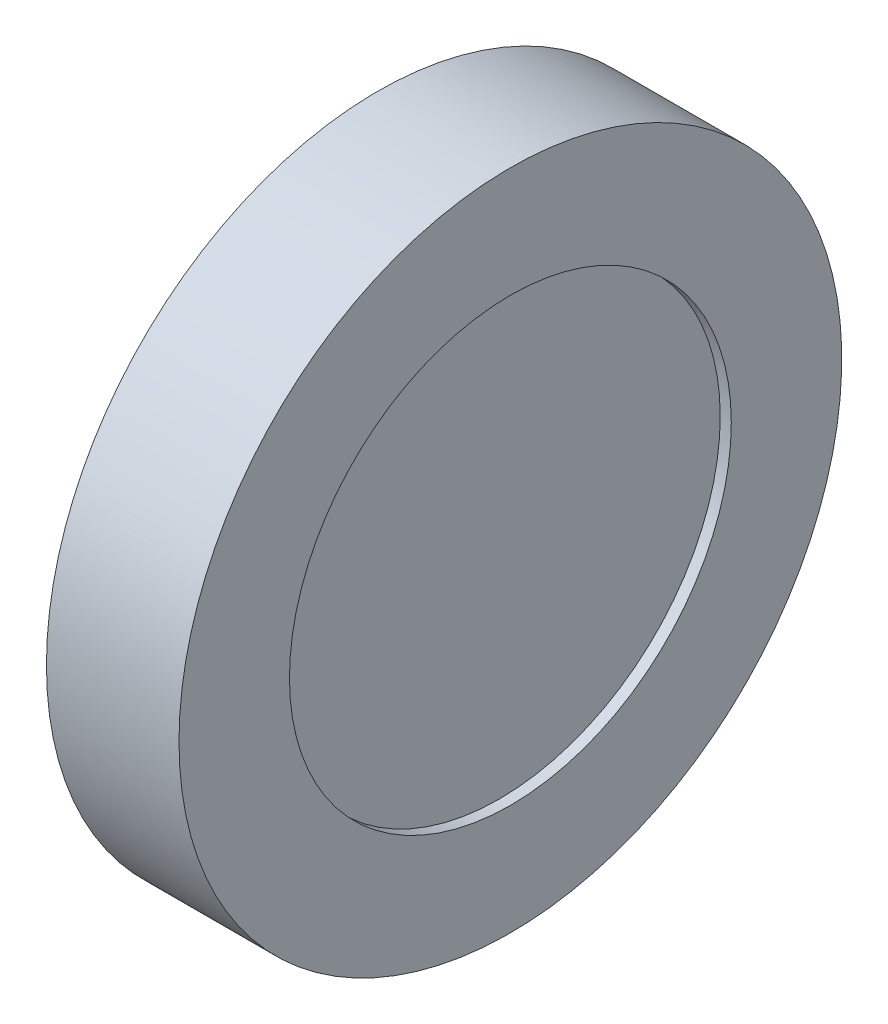
ISO-10303-21;
HEADER;
FILE_DESCRIPTION(('STEP AP214'),'2;1');
FILE_NAME('part.step','',(''),(''),'','','');
FILE_SCHEMA(('AUTOMOTIVE_DESIGN { 1 0 10303 214 1 1 1 1 }'));
ENDSEC;
DATA;
#1=APPLICATION_CONTEXT('core data for automotive mechanical design processes');
#2=APPLICATION_PROTOCOL_DEFINITION('international standard','automotive_design',2000,#1);
#3=PRODUCT_CONTEXT('',#1,'mechanical');
#4=PRODUCT('Part','Part','',(#3));
#5=PRODUCT_RELATED_PRODUCT_CATEGORY('part','',(#4));
#6=PRODUCT_DEFINITION_FORMATION('','',#4);
#7=PRODUCT_DEFINITION_CONTEXT('part definition',#1,'design');
#8=PRODUCT_DEFINITION('design','',#6,#7);
#9=PRODUCT_DEFINITION_SHAPE('','',#8);
#10=(LENGTH_UNIT() NAMED_UNIT(*) SI_UNIT(.MILLI.,.METRE.));
#11=(NAMED_UNIT(*) PLANE_ANGLE_UNIT() SI_UNIT($,.RADIAN.));
#12=(NAMED_UNIT(*) SI_UNIT($,.STERADIAN.) SOLID_ANGLE_UNIT());
#13=UNCERTAINTY_MEASURE_WITH_UNIT(LENGTH_MEASURE(1.E-05),#10,'distance_accuracy_value','');
#14=(GEOMETRIC_REPRESENTATION_CONTEXT(3) GLOBAL_UNCERTAINTY_ASSIGNED_CONTEXT((#13)) GLOBAL_UNIT_ASSIGNED_CONTEXT((#10,
#11,#12)) REPRESENTATION_CONTEXT('',''));
#15=CARTESIAN_POINT('',(0.,0.,0.));
#16=DIRECTION('',(0.,0.,1.));
#17=DIRECTION('',(1.,0.,0.));
#18=AXIS2_PLACEMENT_3D('',#15,#16,#17);
#19=CARTESIAN_POINT('',(2.5,10.,0.));
#20=DIRECTION('',(-1.,0.,0.));
#21=DIRECTION('',(0.,0.,1.));
#22=AXIS2_PLACEMENT_3D('',#19,#20,#21);
#23=PLANE('',#22);
#24=CARTESIAN_POINT('',(2.5,0.,0.));
#25=DIRECTION('',(-1.,0.,0.));
#26=DIRECTION('',(0.,0.,1.));
#27=AXIS2_PLACEMENT_3D('',#24,#25,#26);
#28=CIRCLE('',#27,10.);
#29=CARTESIAN_POINT('',(2.5,0.,10.));
#30=VERTEX_POINT('',#29);
#31=EDGE_CURVE('E10',#30,#30,#28,.T.);
#32=ORIENTED_EDGE('',*,*,#31,.F.);
#33=EDGE_LOOP('',(#32));
#34=FACE_BOUND('',#33,.T.);
#35=ADVANCED_FACE('F37',(#34),#23,.F.);
#36=CARTESIAN_POINT('',(-1.61421241885762,0.,0.));
#37=DIRECTION('',(-1.,0.,0.));
#38=DIRECTION('',(0.,0.,1.));
#39=AXIS2_PLACEMENT_3D('',#36,#37,#38);
#40=CYLINDRICAL_SURFACE('',#39,10.);
#41=CARTESIAN_POINT('',(3.,0.,0.));
#42=DIRECTION('',(-1.,0.,0.));
#43=DIRECTION('',(0.,0.,1.));
#44=AXIS2_PLACEMENT_3D('',#41,#42,#43);
#45=CIRCLE('',#44,10.);
#46=CARTESIAN_POINT('',(3.,0.,10.));
#47=VERTEX_POINT('',#46);
#48=EDGE_CURVE('E60',#47,#47,#45,.T.);
#49=ORIENTED_EDGE('',*,*,#48,.F.);
#50=EDGE_LOOP('',(#49));
#51=FACE_BOUND('',#50,.T.);
#52=ORIENTED_EDGE('',*,*,#31,.T.);
#53=EDGE_LOOP('',(#52));
#54=FACE_BOUND('',#53,.T.);
#55=ADVANCED_FACE('F90',(#51,#54),#40,.F.);
#56=CARTESIAN_POINT('',(-3.,0.,0.));
#57=DIRECTION('',(-1.,0.,0.));
#58=DIRECTION('',(0.,0.,1.));
#59=AXIS2_PLACEMENT_3D('',#56,#57,#58);
#60=CIRCLE('',#59,10.);
#61=CARTESIAN_POINT('',(-3.,0.,10.));
#62=VERTEX_POINT('',#61);
#63=EDGE_CURVE('E64',#62,#62,#60,.T.);
#64=ORIENTED_EDGE('',*,*,#63,.T.);
#65=EDGE_LOOP('',(#64));
#66=FACE_BOUND('',#65,.T.);
#67=CARTESIAN_POINT('',(-2.5,0.,0.));
#68=DIRECTION('',(1.,0.,0.));
#69=DIRECTION('',(0.,0.,-1.));
#70=AXIS2_PLACEMENT_3D('',#67,#68,#69);
#71=CIRCLE('',#70,10.);
#72=CARTESIAN_POINT('',(-2.5,0.,-10.));
#73=VERTEX_POINT('',#72);
#74=EDGE_CURVE('E44',#73,#73,#71,.T.);
#75=ORIENTED_EDGE('',*,*,#74,.T.);
#76=EDGE_LOOP('',(#75));
#77=FACE_BOUND('',#76,.T.);
#78=ADVANCED_FACE('F69',(#66,#77),#40,.F.);
#79=CARTESIAN_POINT('',(-3.,10.,0.));
#80=DIRECTION('',(1.,0.,0.));
#81=DIRECTION('',(0.,0.,-1.));
#82=AXIS2_PLACEMENT_3D('',#79,#80,#81);
#83=PLANE('',#82);
#84=ORIENTED_EDGE('',*,*,#63,.F.);
#85=EDGE_LOOP('',(#84));
#86=FACE_BOUND('',#85,.T.);
#87=CARTESIAN_POINT('',(-3.,0.,0.));
#88=DIRECTION('',(-1.,0.,0.));
#89=DIRECTION('',(0.,0.,1.));
#90=AXIS2_PLACEMENT_3D('',#87,#88,#89);
#91=CIRCLE('',#90,15.);
#92=CARTESIAN_POINT('',(-3.,0.,15.));
#93=VERTEX_POINT('',#92);
#94=EDGE_CURVE('E49',#93,#93,#91,.T.);
#95=ORIENTED_EDGE('',*,*,#94,.T.);
#96=EDGE_LOOP('',(#95));
#97=FACE_BOUND('',#96,.T.);
#98=ADVANCED_FACE('F71',(#86,#97),#83,.F.);
#99=CARTESIAN_POINT('',(-1.61421241885762,0.,0.));
#100=DIRECTION('',(-1.,0.,0.));
#101=DIRECTION('',(0.,0.,1.));
#102=AXIS2_PLACEMENT_3D('',#99,#100,#101);
#103=CYLINDRICAL_SURFACE('',#102,15.);
#104=ORIENTED_EDGE('',*,*,#94,.F.);
#105=EDGE_LOOP('',(#104));
#106=FACE_BOUND('',#105,.T.);
#107=CARTESIAN_POINT('',(3.,0.,0.));
#108=DIRECTION('',(-1.,0.,0.));
#109=DIRECTION('',(0.,0.,1.));
#110=AXIS2_PLACEMENT_3D('',#107,#108,#109);
#111=CIRCLE('',#110,15.);
#112=CARTESIAN_POINT('',(3.,0.,15.));
#113=VERTEX_POINT('',#112);
#114=EDGE_CURVE('E54',#113,#113,#111,.T.);
#115=ORIENTED_EDGE('',*,*,#114,.T.);
#116=EDGE_LOOP('',(#115));
#117=FACE_BOUND('',#116,.T.);
#118=ADVANCED_FACE('F74',(#106,#117),#103,.T.);
#119=CARTESIAN_POINT('',(3.,15.,0.));
#120=DIRECTION('',(-1.,0.,0.));
#121=DIRECTION('',(0.,0.,1.));
#122=AXIS2_PLACEMENT_3D('',#119,#120,#121);
#123=PLANE('',#122);
#124=ORIENTED_EDGE('',*,*,#114,.F.);
#125=EDGE_LOOP('',(#124));
#126=FACE_BOUND('',#125,.T.);
#127=ORIENTED_EDGE('',*,*,#48,.T.);
#128=EDGE_LOOP('',(#127));
#129=FACE_BOUND('',#128,.T.);
#130=ADVANCED_FACE('F80',(#126,#129),#123,.F.);
#131=CARTESIAN_POINT('',(-2.5,10.,0.));
#132=DIRECTION('',(1.,0.,0.));
#133=DIRECTION('',(0.,0.,-1.));
#134=AXIS2_PLACEMENT_3D('',#131,#132,#133);
#135=PLANE('',#134);
#136=ORIENTED_EDGE('',*,*,#74,.F.);
#137=EDGE_LOOP('',(#136));
#138=FACE_BOUND('',#137,.T.);
#139=ADVANCED_FACE('F86',(#138),#135,.F.);
#140=CLOSED_SHELL('',(#35,#55,#78,#98,#118,#130,#139));
#141=MANIFOLD_SOLID_BREP('B2',#140);
#142=ADVANCED_BREP_SHAPE_REPRESENTATION('',(#18,#141),#14);
#143=SHAPE_DEFINITION_REPRESENTATION(#9,#142);
ENDSEC;
END-ISO-10303-21;
